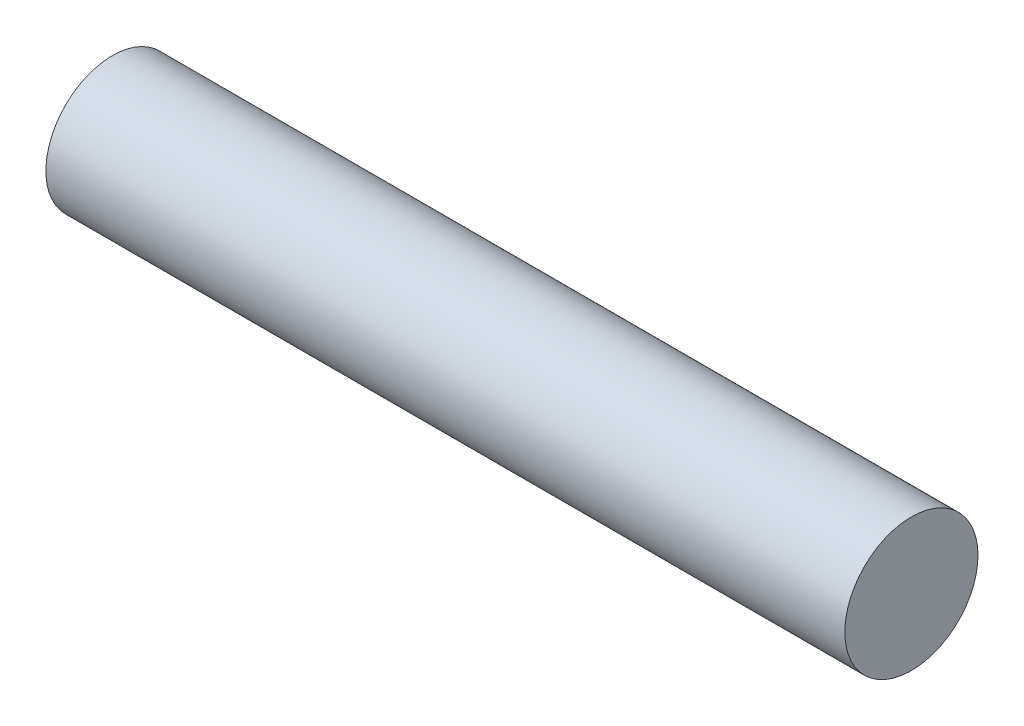
ISO-10303-21;
HEADER;
FILE_DESCRIPTION(('STEP AP214'),'2;1');
FILE_NAME('part.step','',(''),(''),'','','');
FILE_SCHEMA(('AUTOMOTIVE_DESIGN { 1 0 10303 214 1 1 1 1 }'));
ENDSEC;
DATA;
#1=APPLICATION_CONTEXT('core data for automotive mechanical design processes');
#2=APPLICATION_PROTOCOL_DEFINITION('international standard','automotive_design',2000,#1);
#3=PRODUCT_CONTEXT('',#1,'mechanical');
#4=PRODUCT('Part','Part','',(#3));
#5=PRODUCT_RELATED_PRODUCT_CATEGORY('part','',(#4));
#6=PRODUCT_DEFINITION_FORMATION('','',#4);
#7=PRODUCT_DEFINITION_CONTEXT('part definition',#1,'design');
#8=PRODUCT_DEFINITION('design','',#6,#7);
#9=PRODUCT_DEFINITION_SHAPE('','',#8);
#10=(LENGTH_UNIT() NAMED_UNIT(*) SI_UNIT(.MILLI.,.METRE.));
#11=(NAMED_UNIT(*) PLANE_ANGLE_UNIT() SI_UNIT($,.RADIAN.));
#12=(NAMED_UNIT(*) SI_UNIT($,.STERADIAN.) SOLID_ANGLE_UNIT());
#13=UNCERTAINTY_MEASURE_WITH_UNIT(LENGTH_MEASURE(1.E-05),#10,'distance_accuracy_value','');
#14=(GEOMETRIC_REPRESENTATION_CONTEXT(3) GLOBAL_UNCERTAINTY_ASSIGNED_CONTEXT((#13)) GLOBAL_UNIT_ASSIGNED_CONTEXT((#10,
#11,#12)) REPRESENTATION_CONTEXT('',''));
#15=CARTESIAN_POINT('',(0.,0.,0.));
#16=DIRECTION('',(0.,0.,1.));
#17=DIRECTION('',(1.,0.,0.));
#18=AXIS2_PLACEMENT_3D('',#15,#16,#17);
#19=CARTESIAN_POINT('',(60.,0.,0.));
#20=DIRECTION('',(-1.,0.,0.));
#21=DIRECTION('',(0.,0.,1.));
#22=AXIS2_PLACEMENT_3D('',#19,#20,#21);
#23=CYLINDRICAL_SURFACE('',#22,5.);
#24=CARTESIAN_POINT('',(60.,0.,0.));
#25=DIRECTION('',(1.,0.,0.));
#26=DIRECTION('',(0.,0.,-1.));
#27=AXIS2_PLACEMENT_3D('',#24,#25,#26);
#28=CIRCLE('',#27,5.);
#29=CARTESIAN_POINT('',(60.,0.,-5.));
#30=VERTEX_POINT('',#29);
#31=EDGE_CURVE('E10',#30,#30,#28,.T.);
#32=ORIENTED_EDGE('',*,*,#31,.F.);
#33=EDGE_LOOP('',(#32));
#34=FACE_BOUND('',#33,.T.);
#35=CARTESIAN_POINT('',(0.,0.,0.));
#36=DIRECTION('',(1.,0.,0.));
#37=DIRECTION('',(0.,0.,-1.));
#38=AXIS2_PLACEMENT_3D('',#35,#36,#37);
#39=CIRCLE('',#38,5.);
#40=CARTESIAN_POINT('',(0.,0.,-5.));
#41=VERTEX_POINT('',#40);
#42=EDGE_CURVE('E34',#41,#41,#39,.T.);
#43=ORIENTED_EDGE('',*,*,#42,.T.);
#44=EDGE_LOOP('',(#43));
#45=FACE_BOUND('',#44,.T.);
#46=ADVANCED_FACE('F31',(#34,#45),#23,.T.);
#47=CARTESIAN_POINT('',(60.,0.,0.));
#48=DIRECTION('',(1.,0.,0.));
#49=DIRECTION('',(0.,0.,-1.));
#50=AXIS2_PLACEMENT_3D('',#47,#48,#49);
#51=PLANE('',#50);
#52=ORIENTED_EDGE('',*,*,#31,.T.);
#53=EDGE_LOOP('',(#52));
#54=FACE_BOUND('',#53,.T.);
#55=ADVANCED_FACE('F46',(#54),#51,.T.);
#56=CARTESIAN_POINT('',(0.,0.,0.));
#57=DIRECTION('',(1.,0.,0.));
#58=DIRECTION('',(0.,0.,-1.));
#59=AXIS2_PLACEMENT_3D('',#56,#57,#58);
#60=PLANE('',#59);
#61=ORIENTED_EDGE('',*,*,#42,.F.);
#62=EDGE_LOOP('',(#61));
#63=FACE_BOUND('',#62,.T.);
#64=ADVANCED_FACE('F44',(#63),#60,.F.);
#65=CLOSED_SHELL('',(#46,#55,#64));
#66=MANIFOLD_SOLID_BREP('B2',#65);
#67=ADVANCED_BREP_SHAPE_REPRESENTATION('',(#18,#66),#14);
#68=SHAPE_DEFINITION_REPRESENTATION(#9,#67);
ENDSEC;
END-ISO-10303-21;
